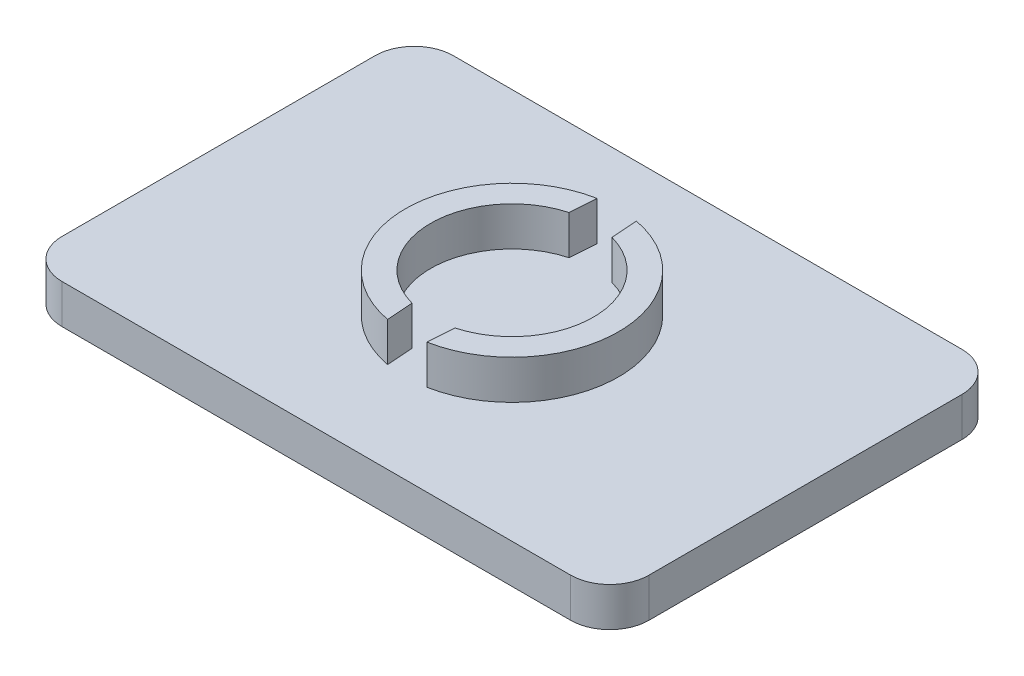
ISO-10303-21;
HEADER;
FILE_DESCRIPTION(('STEP AP214'),'2;1');
FILE_NAME('part.step','',(''),(''),'','','');
FILE_SCHEMA(('AUTOMOTIVE_DESIGN { 1 0 10303 214 1 1 1 1 }'));
ENDSEC;
DATA;
#1=APPLICATION_CONTEXT('core data for automotive mechanical design processes');
#2=APPLICATION_PROTOCOL_DEFINITION('international standard','automotive_design',2000,#1);
#3=PRODUCT_CONTEXT('',#1,'mechanical');
#4=PRODUCT('Part','Part','',(#3));
#5=PRODUCT_RELATED_PRODUCT_CATEGORY('part','',(#4));
#6=PRODUCT_DEFINITION_FORMATION('','',#4);
#7=PRODUCT_DEFINITION_CONTEXT('part definition',#1,'design');
#8=PRODUCT_DEFINITION('design','',#6,#7);
#9=PRODUCT_DEFINITION_SHAPE('','',#8);
#10=(LENGTH_UNIT() NAMED_UNIT(*) SI_UNIT(.MILLI.,.METRE.));
#11=(NAMED_UNIT(*) PLANE_ANGLE_UNIT() SI_UNIT($,.RADIAN.));
#12=(NAMED_UNIT(*) SI_UNIT($,.STERADIAN.) SOLID_ANGLE_UNIT());
#13=UNCERTAINTY_MEASURE_WITH_UNIT(LENGTH_MEASURE(1.E-05),#10,'distance_accuracy_value','');
#14=(GEOMETRIC_REPRESENTATION_CONTEXT(3) GLOBAL_UNCERTAINTY_ASSIGNED_CONTEXT((#13)) GLOBAL_UNIT_ASSIGNED_CONTEXT((#10,
#11,#12)) REPRESENTATION_CONTEXT('',''));
#15=CARTESIAN_POINT('',(0.,0.,0.));
#16=DIRECTION('',(0.,0.,1.));
#17=DIRECTION('',(1.,0.,0.));
#18=AXIS2_PLACEMENT_3D('',#15,#16,#17);
#19=CARTESIAN_POINT('',(0.,5.08,0.));
#20=DIRECTION('',(0.,-1.,0.));
#21=DIRECTION('',(0.,0.,-1.));
#22=AXIS2_PLACEMENT_3D('',#19,#20,#21);
#23=PLANE('',#22);
#24=DIRECTION('',(-0.0741774245024507,0.,-0.99724505999989));
#25=VECTOR('',#24,1.);
#26=CARTESIAN_POINT('',(-3.53248268967324,5.08,0.262754340462192));
#27=LINE('',#26,#25);
#28=CARTESIAN_POINT('',(-2.53999999999999,5.08,13.6057419954103));
#29=VERTEX_POINT('',#28);
#30=CARTESIAN_POINT('',(-2.79399999999999,5.08,10.1909531032507));
#31=VERTEX_POINT('',#30);
#32=EDGE_CURVE('E184',#29,#31,#27,.T.);
#33=ORIENTED_EDGE('',*,*,#32,.F.);
#34=CARTESIAN_POINT('',(0.,5.08,0.));
#35=DIRECTION('',(0.,-1.,0.));
#36=DIRECTION('',(0.,0.,-1.));
#37=AXIS2_PLACEMENT_3D('',#34,#35,#36);
#38=CIRCLE('',#37,13.8408025506353);
#39=CARTESIAN_POINT('',(-2.54000000000001,5.08,-13.6057419954103));
#40=VERTEX_POINT('',#39);
#41=EDGE_CURVE('E211',#29,#40,#38,.T.);
#42=ORIENTED_EDGE('',*,*,#41,.T.);
#43=DIRECTION('',(0.0741774245024495,0.,-0.99724505999989));
#44=VECTOR('',#43,1.);
#45=CARTESIAN_POINT('',(-3.53248268967323,5.08,-0.262754340462187));
#46=LINE('',#45,#44);
#47=CARTESIAN_POINT('',(-2.794,5.08,-10.1909531032507));
#48=VERTEX_POINT('',#47);
#49=EDGE_CURVE('E69',#48,#40,#46,.T.);
#50=ORIENTED_EDGE('',*,*,#49,.F.);
#51=CARTESIAN_POINT('',(0.,5.08,0.));
#52=DIRECTION('',(0.,-1.,0.));
#53=DIRECTION('',(0.,0.,-1.));
#54=AXIS2_PLACEMENT_3D('',#51,#52,#53);
#55=CIRCLE('',#54,10.5670223408799);
#56=EDGE_CURVE('E189',#31,#48,#55,.T.);
#57=ORIENTED_EDGE('',*,*,#56,.F.);
#58=EDGE_LOOP('',(#33,#42,#50,#57));
#59=FACE_BOUND('',#58,.T.);
#60=DIRECTION('',(-1.,0.,0.));
#61=VECTOR('',#60,1.);
#62=CARTESIAN_POINT('',(38.1,5.08,-25.4));
#63=LINE('',#62,#61);
#64=CARTESIAN_POINT('',(33.02,5.08,-25.4));
#65=VERTEX_POINT('',#64);
#66=CARTESIAN_POINT('',(-33.02,5.08,-25.4));
#67=VERTEX_POINT('',#66);
#68=EDGE_CURVE('E241',#65,#67,#63,.T.);
#69=ORIENTED_EDGE('',*,*,#68,.T.);
#70=CARTESIAN_POINT('',(-33.02,5.08,-20.32));
#71=DIRECTION('',(0.,-1.,0.));
#72=DIRECTION('',(0.,0.,-1.));
#73=AXIS2_PLACEMENT_3D('',#70,#71,#72);
#74=CIRCLE('',#73,5.08);
#75=CARTESIAN_POINT('',(-38.1,5.08,-20.32));
#76=VERTEX_POINT('',#75);
#77=EDGE_CURVE('E307',#67,#76,#74,.F.);
#78=ORIENTED_EDGE('',*,*,#77,.T.);
#79=DIRECTION('',(0.,0.,-1.));
#80=VECTOR('',#79,1.);
#81=CARTESIAN_POINT('',(-38.1,5.08,25.4));
#82=LINE('',#81,#80);
#83=CARTESIAN_POINT('',(-38.1,5.08,20.32));
#84=VERTEX_POINT('',#83);
#85=EDGE_CURVE('E245',#84,#76,#82,.T.);
#86=ORIENTED_EDGE('',*,*,#85,.F.);
#87=CARTESIAN_POINT('',(-33.02,5.08,20.32));
#88=DIRECTION('',(0.,-1.,0.));
#89=DIRECTION('',(0.,0.,-1.));
#90=AXIS2_PLACEMENT_3D('',#87,#88,#89);
#91=CIRCLE('',#90,5.08);
#92=CARTESIAN_POINT('',(-33.02,5.08,25.4));
#93=VERTEX_POINT('',#92);
#94=EDGE_CURVE('E298',#84,#93,#91,.F.);
#95=ORIENTED_EDGE('',*,*,#94,.T.);
#96=DIRECTION('',(-1.,0.,0.));
#97=VECTOR('',#96,1.);
#98=CARTESIAN_POINT('',(38.1,5.08,25.4));
#99=LINE('',#98,#97);
#100=CARTESIAN_POINT('',(33.02,5.08,25.4));
#101=VERTEX_POINT('',#100);
#102=EDGE_CURVE('E250',#101,#93,#99,.T.);
#103=ORIENTED_EDGE('',*,*,#102,.F.);
#104=CARTESIAN_POINT('',(33.02,5.08,20.32));
#105=DIRECTION('',(0.,-1.,0.));
#106=DIRECTION('',(0.,0.,-1.));
#107=AXIS2_PLACEMENT_3D('',#104,#105,#106);
#108=CIRCLE('',#107,5.08);
#109=CARTESIAN_POINT('',(38.1,5.08,20.32));
#110=VERTEX_POINT('',#109);
#111=EDGE_CURVE('E301',#101,#110,#108,.F.);
#112=ORIENTED_EDGE('',*,*,#111,.T.);
#113=DIRECTION('',(0.,0.,-1.));
#114=VECTOR('',#113,1.);
#115=CARTESIAN_POINT('',(38.1,5.08,25.4));
#116=LINE('',#115,#114);
#117=CARTESIAN_POINT('',(38.1,5.08,-20.32));
#118=VERTEX_POINT('',#117);
#119=EDGE_CURVE('E254',#110,#118,#116,.T.);
#120=ORIENTED_EDGE('',*,*,#119,.T.);
#121=CARTESIAN_POINT('',(33.02,5.08,-20.32));
#122=DIRECTION('',(0.,-1.,0.));
#123=DIRECTION('',(0.,0.,-1.));
#124=AXIS2_PLACEMENT_3D('',#121,#122,#123);
#125=CIRCLE('',#124,5.08);
#126=EDGE_CURVE('E304',#118,#65,#125,.F.);
#127=ORIENTED_EDGE('',*,*,#126,.T.);
#128=EDGE_LOOP('',(#69,#78,#86,#95,#103,#112,#120,#127));
#129=FACE_BOUND('',#128,.T.);
#130=CARTESIAN_POINT('',(0.,5.08,0.));
#131=DIRECTION('',(0.,-1.,0.));
#132=DIRECTION('',(0.,0.,-1.));
#133=AXIS2_PLACEMENT_3D('',#130,#131,#132);
#134=CIRCLE('',#133,10.5670223408799);
#135=CARTESIAN_POINT('',(2.794,5.08,-10.1909531032507));
#136=VERTEX_POINT('',#135);
#137=CARTESIAN_POINT('',(2.79400000000001,5.08,10.1909531032507));
#138=VERTEX_POINT('',#137);
#139=EDGE_CURVE('E165',#136,#138,#134,.T.);
#140=ORIENTED_EDGE('',*,*,#139,.F.);
#141=DIRECTION('',(-0.0741774245024498,0.,-0.99724505999989));
#142=VECTOR('',#141,1.);
#143=CARTESIAN_POINT('',(3.53248268967323,5.08,-0.262754340462189));
#144=LINE('',#143,#142);
#145=CARTESIAN_POINT('',(2.54,5.08,-13.6057419954103));
#146=VERTEX_POINT('',#145);
#147=EDGE_CURVE('E176',#136,#146,#144,.T.);
#148=ORIENTED_EDGE('',*,*,#147,.T.);
#149=CARTESIAN_POINT('',(0.,5.08,0.));
#150=DIRECTION('',(0.,-1.,0.));
#151=DIRECTION('',(0.,0.,-1.));
#152=AXIS2_PLACEMENT_3D('',#149,#150,#151);
#153=CIRCLE('',#152,13.8408025506353);
#154=CARTESIAN_POINT('',(2.54,5.08,13.6057419954103));
#155=VERTEX_POINT('',#154);
#156=EDGE_CURVE('E61',#146,#155,#153,.T.);
#157=ORIENTED_EDGE('',*,*,#156,.T.);
#158=DIRECTION('',(0.0741774245024505,0.,-0.99724505999989));
#159=VECTOR('',#158,1.);
#160=CARTESIAN_POINT('',(3.53248268967324,5.08,0.262754340462192));
#161=LINE('',#160,#159);
#162=EDGE_CURVE('E182',#155,#138,#161,.T.);
#163=ORIENTED_EDGE('',*,*,#162,.T.);
#164=EDGE_LOOP('',(#140,#148,#157,#163));
#165=FACE_BOUND('',#164,.T.);
#166=ADVANCED_FACE('F45',(#59,#129,#165),#23,.F.);
#167=CARTESIAN_POINT('',(38.1,5.08,-25.4));
#168=DIRECTION('',(0.,0.,1.));
#169=DIRECTION('',(1.,0.,0.));
#170=AXIS2_PLACEMENT_3D('',#167,#168,#169);
#171=PLANE('',#170);
#172=DIRECTION('',(-1.,0.,0.));
#173=VECTOR('',#172,1.);
#174=CARTESIAN_POINT('',(38.1,0.,-25.4));
#175=LINE('',#174,#173);
#176=CARTESIAN_POINT('',(33.02,0.,-25.4));
#177=VERTEX_POINT('',#176);
#178=CARTESIAN_POINT('',(-33.02,0.,-25.4));
#179=VERTEX_POINT('',#178);
#180=EDGE_CURVE('E240',#177,#179,#175,.T.);
#181=ORIENTED_EDGE('',*,*,#180,.T.);
#182=DIRECTION('',(0.,-1.,0.));
#183=VECTOR('',#182,1.);
#184=CARTESIAN_POINT('',(-33.02,5.08,-25.4));
#185=LINE('',#184,#183);
#186=EDGE_CURVE('E295',#179,#67,#185,.F.);
#187=ORIENTED_EDGE('',*,*,#186,.T.);
#188=ORIENTED_EDGE('',*,*,#68,.F.);
#189=DIRECTION('',(0.,-1.,0.));
#190=VECTOR('',#189,1.);
#191=CARTESIAN_POINT('',(33.02,5.08,-25.4));
#192=LINE('',#191,#190);
#193=EDGE_CURVE('E291',#65,#177,#192,.T.);
#194=ORIENTED_EDGE('',*,*,#193,.T.);
#195=EDGE_LOOP('',(#181,#187,#188,#194));
#196=FACE_BOUND('',#195,.T.);
#197=ADVANCED_FACE('F346',(#196),#171,.F.);
#198=CARTESIAN_POINT('',(-38.1,5.08,25.4));
#199=DIRECTION('',(-1.,0.,0.));
#200=DIRECTION('',(0.,0.,1.));
#201=AXIS2_PLACEMENT_3D('',#198,#199,#200);
#202=PLANE('',#201);
#203=ORIENTED_EDGE('',*,*,#85,.T.);
#204=DIRECTION('',(0.,-1.,0.));
#205=VECTOR('',#204,1.);
#206=CARTESIAN_POINT('',(-38.1,0.,-20.32));
#207=LINE('',#206,#205);
#208=CARTESIAN_POINT('',(-38.1,0.,-20.32));
#209=VERTEX_POINT('',#208);
#210=EDGE_CURVE('E275',#76,#209,#207,.T.);
#211=ORIENTED_EDGE('',*,*,#210,.T.);
#212=DIRECTION('',(0.,0.,-1.));
#213=VECTOR('',#212,1.);
#214=CARTESIAN_POINT('',(-38.1,0.,25.4));
#215=LINE('',#214,#213);
#216=CARTESIAN_POINT('',(-38.1,0.,20.32));
#217=VERTEX_POINT('',#216);
#218=EDGE_CURVE('E262',#217,#209,#215,.T.);
#219=ORIENTED_EDGE('',*,*,#218,.F.);
#220=DIRECTION('',(0.,-1.,0.));
#221=VECTOR('',#220,1.);
#222=CARTESIAN_POINT('',(-38.1,5.08,20.32));
#223=LINE('',#222,#221);
#224=EDGE_CURVE('E258',#217,#84,#223,.F.);
#225=ORIENTED_EDGE('',*,*,#224,.T.);
#226=EDGE_LOOP('',(#203,#211,#219,#225));
#227=FACE_BOUND('',#226,.T.);
#228=ADVANCED_FACE('F353',(#227),#202,.T.);
#229=CARTESIAN_POINT('',(38.1,5.08,25.4));
#230=DIRECTION('',(0.,0.,1.));
#231=DIRECTION('',(1.,0.,0.));
#232=AXIS2_PLACEMENT_3D('',#229,#230,#231);
#233=PLANE('',#232);
#234=DIRECTION('',(-1.,0.,0.));
#235=VECTOR('',#234,1.);
#236=CARTESIAN_POINT('',(38.1,0.,25.4));
#237=LINE('',#236,#235);
#238=CARTESIAN_POINT('',(33.02,0.,25.4));
#239=VERTEX_POINT('',#238);
#240=CARTESIAN_POINT('',(-33.02,0.,25.4));
#241=VERTEX_POINT('',#240);
#242=EDGE_CURVE('E266',#239,#241,#237,.T.);
#243=ORIENTED_EDGE('',*,*,#242,.F.);
#244=DIRECTION('',(0.,-1.,0.));
#245=VECTOR('',#244,1.);
#246=CARTESIAN_POINT('',(33.02,5.08,25.4));
#247=LINE('',#246,#245);
#248=EDGE_CURVE('E11',#239,#101,#247,.F.);
#249=ORIENTED_EDGE('',*,*,#248,.T.);
#250=ORIENTED_EDGE('',*,*,#102,.T.);
#251=DIRECTION('',(0.,-1.,0.));
#252=VECTOR('',#251,1.);
#253=CARTESIAN_POINT('',(-33.02,5.08,25.4));
#254=LINE('',#253,#252);
#255=EDGE_CURVE('E54',#93,#241,#254,.T.);
#256=ORIENTED_EDGE('',*,*,#255,.T.);
#257=EDGE_LOOP('',(#243,#249,#250,#256));
#258=FACE_BOUND('',#257,.T.);
#259=ADVANCED_FACE('F321',(#258),#233,.T.);
#260=CARTESIAN_POINT('',(38.1,5.08,25.4));
#261=DIRECTION('',(-1.,0.,0.));
#262=DIRECTION('',(0.,0.,1.));
#263=AXIS2_PLACEMENT_3D('',#260,#261,#262);
#264=PLANE('',#263);
#265=DIRECTION('',(0.,0.,-1.));
#266=VECTOR('',#265,1.);
#267=CARTESIAN_POINT('',(38.1,0.,25.4));
#268=LINE('',#267,#266);
#269=CARTESIAN_POINT('',(38.1,0.,20.32));
#270=VERTEX_POINT('',#269);
#271=CARTESIAN_POINT('',(38.1,0.,-20.32));
#272=VERTEX_POINT('',#271);
#273=EDGE_CURVE('E246',#270,#272,#268,.T.);
#274=ORIENTED_EDGE('',*,*,#273,.T.);
#275=DIRECTION('',(0.,-1.,0.));
#276=VECTOR('',#275,1.);
#277=CARTESIAN_POINT('',(38.1,5.08,-20.32));
#278=LINE('',#277,#276);
#279=EDGE_CURVE('E314',#272,#118,#278,.F.);
#280=ORIENTED_EDGE('',*,*,#279,.T.);
#281=ORIENTED_EDGE('',*,*,#119,.F.);
#282=DIRECTION('',(0.,-1.,0.));
#283=VECTOR('',#282,1.);
#284=CARTESIAN_POINT('',(38.1,0.,20.32));
#285=LINE('',#284,#283);
#286=EDGE_CURVE('E310',#110,#270,#285,.T.);
#287=ORIENTED_EDGE('',*,*,#286,.T.);
#288=EDGE_LOOP('',(#274,#280,#281,#287));
#289=FACE_BOUND('',#288,.T.);
#290=ADVANCED_FACE('F336',(#289),#264,.F.);
#291=CARTESIAN_POINT('',(0.,0.,0.));
#292=DIRECTION('',(0.,-1.,0.));
#293=DIRECTION('',(0.,0.,-1.));
#294=AXIS2_PLACEMENT_3D('',#291,#292,#293);
#295=PLANE('',#294);
#296=ORIENTED_EDGE('',*,*,#218,.T.);
#297=CARTESIAN_POINT('',(-33.02,0.,-20.32));
#298=DIRECTION('',(0.,-1.,0.));
#299=DIRECTION('',(0.,0.,-1.));
#300=AXIS2_PLACEMENT_3D('',#297,#298,#299);
#301=CIRCLE('',#300,5.08);
#302=EDGE_CURVE('E288',#209,#179,#301,.T.);
#303=ORIENTED_EDGE('',*,*,#302,.T.);
#304=ORIENTED_EDGE('',*,*,#180,.F.);
#305=CARTESIAN_POINT('',(33.02,0.,-20.32));
#306=DIRECTION('',(0.,-1.,0.));
#307=DIRECTION('',(0.,0.,-1.));
#308=AXIS2_PLACEMENT_3D('',#305,#306,#307);
#309=CIRCLE('',#308,5.08);
#310=EDGE_CURVE('E285',#177,#272,#309,.T.);
#311=ORIENTED_EDGE('',*,*,#310,.T.);
#312=ORIENTED_EDGE('',*,*,#273,.F.);
#313=CARTESIAN_POINT('',(33.02,0.,20.32));
#314=DIRECTION('',(0.,-1.,0.));
#315=DIRECTION('',(0.,0.,-1.));
#316=AXIS2_PLACEMENT_3D('',#313,#314,#315);
#317=CIRCLE('',#316,5.08);
#318=EDGE_CURVE('E282',#270,#239,#317,.T.);
#319=ORIENTED_EDGE('',*,*,#318,.T.);
#320=ORIENTED_EDGE('',*,*,#242,.T.);
#321=CARTESIAN_POINT('',(-33.02,0.,20.32));
#322=DIRECTION('',(0.,-1.,0.));
#323=DIRECTION('',(0.,0.,-1.));
#324=AXIS2_PLACEMENT_3D('',#321,#322,#323);
#325=CIRCLE('',#324,5.08);
#326=EDGE_CURVE('E279',#241,#217,#325,.T.);
#327=ORIENTED_EDGE('',*,*,#326,.T.);
#328=EDGE_LOOP('',(#296,#303,#304,#311,#312,#319,#320,#327));
#329=FACE_BOUND('',#328,.T.);
#330=ADVANCED_FACE('F327',(#329),#295,.T.);
#331=CARTESIAN_POINT('',(-33.02,5.08,-20.32));
#332=DIRECTION('',(0.,1.,0.));
#333=DIRECTION('',(0.,0.,1.));
#334=AXIS2_PLACEMENT_3D('',#331,#332,#333);
#335=CYLINDRICAL_SURFACE('',#334,5.08);
#336=ORIENTED_EDGE('',*,*,#77,.F.);
#337=ORIENTED_EDGE('',*,*,#186,.F.);
#338=ORIENTED_EDGE('',*,*,#302,.F.);
#339=ORIENTED_EDGE('',*,*,#210,.F.);
#340=EDGE_LOOP('',(#336,#337,#338,#339));
#341=FACE_BOUND('',#340,.T.);
#342=ADVANCED_FACE('F351',(#341),#335,.T.);
#343=CARTESIAN_POINT('',(33.02,5.08,-20.32));
#344=DIRECTION('',(0.,-1.,0.));
#345=DIRECTION('',(0.,0.,-1.));
#346=AXIS2_PLACEMENT_3D('',#343,#344,#345);
#347=CYLINDRICAL_SURFACE('',#346,5.08);
#348=ORIENTED_EDGE('',*,*,#126,.F.);
#349=ORIENTED_EDGE('',*,*,#279,.F.);
#350=ORIENTED_EDGE('',*,*,#310,.F.);
#351=ORIENTED_EDGE('',*,*,#193,.F.);
#352=EDGE_LOOP('',(#348,#349,#350,#351));
#353=FACE_BOUND('',#352,.T.);
#354=ADVANCED_FACE('F343',(#353),#347,.T.);
#355=CARTESIAN_POINT('',(33.02,5.08,20.32));
#356=DIRECTION('',(0.,1.,0.));
#357=DIRECTION('',(0.,0.,1.));
#358=AXIS2_PLACEMENT_3D('',#355,#356,#357);
#359=CYLINDRICAL_SURFACE('',#358,5.08);
#360=ORIENTED_EDGE('',*,*,#111,.F.);
#361=ORIENTED_EDGE('',*,*,#248,.F.);
#362=ORIENTED_EDGE('',*,*,#318,.F.);
#363=ORIENTED_EDGE('',*,*,#286,.F.);
#364=EDGE_LOOP('',(#360,#361,#362,#363));
#365=FACE_BOUND('',#364,.T.);
#366=ADVANCED_FACE('F333',(#365),#359,.T.);
#367=CARTESIAN_POINT('',(-33.02,5.08,20.32));
#368=DIRECTION('',(0.,-1.,0.));
#369=DIRECTION('',(0.,0.,-1.));
#370=AXIS2_PLACEMENT_3D('',#367,#368,#369);
#371=CYLINDRICAL_SURFACE('',#370,5.08);
#372=ORIENTED_EDGE('',*,*,#94,.F.);
#373=ORIENTED_EDGE('',*,*,#224,.F.);
#374=ORIENTED_EDGE('',*,*,#326,.F.);
#375=ORIENTED_EDGE('',*,*,#255,.F.);
#376=EDGE_LOOP('',(#372,#373,#374,#375));
#377=FACE_BOUND('',#376,.T.);
#378=ADVANCED_FACE('F47',(#377),#371,.T.);
#379=CARTESIAN_POINT('',(-3.53248268967324,10.16,0.262754340462192));
#380=DIRECTION('',(-0.997245059999889,0.,0.0741774245024507));
#381=DIRECTION('',(0.0741774245024507,0.,0.99724505999989));
#382=AXIS2_PLACEMENT_3D('',#379,#380,#381);
#383=PLANE('',#382);
#384=ORIENTED_EDGE('',*,*,#32,.T.);
#385=DIRECTION('',(0.,-1.,0.));
#386=VECTOR('',#385,1.);
#387=CARTESIAN_POINT('',(-2.79399999999999,10.16,10.1909531032507));
#388=LINE('',#387,#386);
#389=CARTESIAN_POINT('',(-2.79399999999999,10.16,10.1909531032507));
#390=VERTEX_POINT('',#389);
#391=EDGE_CURVE('E237',#390,#31,#388,.T.);
#392=ORIENTED_EDGE('',*,*,#391,.F.);
#393=DIRECTION('',(-0.0741774245024507,0.,-0.99724505999989));
#394=VECTOR('',#393,1.);
#395=CARTESIAN_POINT('',(-3.53248268967324,10.16,0.262754340462192));
#396=LINE('',#395,#394);
#397=CARTESIAN_POINT('',(-2.53999999999999,10.16,13.6057419954103));
#398=VERTEX_POINT('',#397);
#399=EDGE_CURVE('E206',#398,#390,#396,.T.);
#400=ORIENTED_EDGE('',*,*,#399,.F.);
#401=DIRECTION('',(0.,-1.,0.));
#402=VECTOR('',#401,1.);
#403=CARTESIAN_POINT('',(-2.53999999999999,10.16,13.6057419954103));
#404=LINE('',#403,#402);
#405=EDGE_CURVE('E220',#398,#29,#404,.T.);
#406=ORIENTED_EDGE('',*,*,#405,.T.);
#407=EDGE_LOOP('',(#384,#392,#400,#406));
#408=FACE_BOUND('',#407,.T.);
#409=ADVANCED_FACE('F357',(#408),#383,.F.);
#410=CARTESIAN_POINT('',(0.,10.16,0.));
#411=DIRECTION('',(0.,-1.,0.));
#412=DIRECTION('',(0.,0.,-1.));
#413=AXIS2_PLACEMENT_3D('',#410,#411,#412);
#414=CYLINDRICAL_SURFACE('',#413,10.5670223408799);
#415=ORIENTED_EDGE('',*,*,#56,.T.);
#416=DIRECTION('',(0.,-1.,0.));
#417=VECTOR('',#416,1.);
#418=CARTESIAN_POINT('',(-2.794,10.16,-10.1909531032507));
#419=LINE('',#418,#417);
#420=CARTESIAN_POINT('',(-2.794,10.16,-10.1909531032507));
#421=VERTEX_POINT('',#420);
#422=EDGE_CURVE('E234',#421,#48,#419,.T.);
#423=ORIENTED_EDGE('',*,*,#422,.F.);
#424=CARTESIAN_POINT('',(0.,10.16,0.));
#425=DIRECTION('',(0.,-1.,0.));
#426=DIRECTION('',(0.,0.,-1.));
#427=AXIS2_PLACEMENT_3D('',#424,#425,#426);
#428=CIRCLE('',#427,10.5670223408799);
#429=EDGE_CURVE('E210',#390,#421,#428,.T.);
#430=ORIENTED_EDGE('',*,*,#429,.F.);
#431=ORIENTED_EDGE('',*,*,#391,.T.);
#432=EDGE_LOOP('',(#415,#423,#430,#431));
#433=FACE_BOUND('',#432,.T.);
#434=ADVANCED_FACE('F362',(#433),#414,.F.);
#435=CARTESIAN_POINT('',(-3.53248268967323,10.16,-0.262754340462187));
#436=DIRECTION('',(-0.99724505999989,0.,-0.0741774245024495));
#437=DIRECTION('',(-0.0741774245024495,0.,0.99724505999989));
#438=AXIS2_PLACEMENT_3D('',#435,#436,#437);
#439=PLANE('',#438);
#440=ORIENTED_EDGE('',*,*,#49,.T.);
#441=DIRECTION('',(0.,-1.,0.));
#442=VECTOR('',#441,1.);
#443=CARTESIAN_POINT('',(-2.54000000000001,10.16,-13.6057419954103));
#444=LINE('',#443,#442);
#445=CARTESIAN_POINT('',(-2.54000000000001,10.16,-13.6057419954103));
#446=VERTEX_POINT('',#445);
#447=EDGE_CURVE('E231',#446,#40,#444,.T.);
#448=ORIENTED_EDGE('',*,*,#447,.F.);
#449=DIRECTION('',(0.0741774245024495,0.,-0.99724505999989));
#450=VECTOR('',#449,1.);
#451=CARTESIAN_POINT('',(-3.53248268967323,10.16,-0.262754340462187));
#452=LINE('',#451,#450);
#453=EDGE_CURVE('E214',#421,#446,#452,.T.);
#454=ORIENTED_EDGE('',*,*,#453,.F.);
#455=ORIENTED_EDGE('',*,*,#422,.T.);
#456=EDGE_LOOP('',(#440,#448,#454,#455));
#457=FACE_BOUND('',#456,.T.);
#458=ADVANCED_FACE('F414',(#457),#439,.F.);
#459=CARTESIAN_POINT('',(0.,10.16,0.));
#460=DIRECTION('',(0.,-1.,0.));
#461=DIRECTION('',(0.,0.,-1.));
#462=AXIS2_PLACEMENT_3D('',#459,#460,#461);
#463=CYLINDRICAL_SURFACE('',#462,13.8408025506353);
#464=ORIENTED_EDGE('',*,*,#41,.F.);
#465=ORIENTED_EDGE('',*,*,#405,.F.);
#466=CARTESIAN_POINT('',(0.,10.16,0.));
#467=DIRECTION('',(0.,-1.,0.));
#468=DIRECTION('',(0.,0.,-1.));
#469=AXIS2_PLACEMENT_3D('',#466,#467,#468);
#470=CIRCLE('',#469,13.8408025506353);
#471=EDGE_CURVE('E217',#398,#446,#470,.T.);
#472=ORIENTED_EDGE('',*,*,#471,.T.);
#473=ORIENTED_EDGE('',*,*,#447,.T.);
#474=EDGE_LOOP('',(#464,#465,#472,#473));
#475=FACE_BOUND('',#474,.T.);
#476=ADVANCED_FACE('F423',(#475),#463,.T.);
#477=CARTESIAN_POINT('',(0.,10.16,0.));
#478=DIRECTION('',(0.,-1.,0.));
#479=DIRECTION('',(0.,0.,-1.));
#480=AXIS2_PLACEMENT_3D('',#477,#478,#479);
#481=PLANE('',#480);
#482=ORIENTED_EDGE('',*,*,#399,.T.);
#483=ORIENTED_EDGE('',*,*,#429,.T.);
#484=ORIENTED_EDGE('',*,*,#453,.T.);
#485=ORIENTED_EDGE('',*,*,#471,.F.);
#486=EDGE_LOOP('',(#482,#483,#484,#485));
#487=FACE_BOUND('',#486,.T.);
#488=ADVANCED_FACE('F432',(#487),#481,.F.);
#489=CARTESIAN_POINT('',(0.,10.16,0.));
#490=DIRECTION('',(0.,-1.,0.));
#491=DIRECTION('',(0.,0.,-1.));
#492=AXIS2_PLACEMENT_3D('',#489,#490,#491);
#493=CYLINDRICAL_SURFACE('',#492,10.5670223408799);
#494=ORIENTED_EDGE('',*,*,#139,.T.);
#495=DIRECTION('',(0.,-1.,0.));
#496=VECTOR('',#495,1.);
#497=CARTESIAN_POINT('',(2.79400000000001,10.16,10.1909531032507));
#498=LINE('',#497,#496);
#499=CARTESIAN_POINT('',(2.79400000000001,10.16,10.1909531032507));
#500=VERTEX_POINT('',#499);
#501=EDGE_CURVE('E612',#500,#138,#498,.T.);
#502=ORIENTED_EDGE('',*,*,#501,.F.);
#503=CARTESIAN_POINT('',(0.,10.16,0.));
#504=DIRECTION('',(0.,-1.,0.));
#505=DIRECTION('',(0.,0.,-1.));
#506=AXIS2_PLACEMENT_3D('',#503,#504,#505);
#507=CIRCLE('',#506,10.5670223408799);
#508=CARTESIAN_POINT('',(2.794,10.16,-10.1909531032507));
#509=VERTEX_POINT('',#508);
#510=EDGE_CURVE('E167',#509,#500,#507,.T.);
#511=ORIENTED_EDGE('',*,*,#510,.F.);
#512=DIRECTION('',(0.,-1.,0.));
#513=VECTOR('',#512,1.);
#514=CARTESIAN_POINT('',(2.794,10.16,-10.1909531032507));
#515=LINE('',#514,#513);
#516=EDGE_CURVE('E160',#509,#136,#515,.T.);
#517=ORIENTED_EDGE('',*,*,#516,.T.);
#518=EDGE_LOOP('',(#494,#502,#511,#517));
#519=FACE_BOUND('',#518,.T.);
#520=ADVANCED_FACE('F162',(#519),#493,.F.);
#521=CARTESIAN_POINT('',(3.53248268967324,10.16,0.262754340462192));
#522=DIRECTION('',(-0.997245059999889,0.,-0.0741774245024504));
#523=DIRECTION('',(-0.0741774245024505,0.,0.99724505999989));
#524=AXIS2_PLACEMENT_3D('',#521,#522,#523);
#525=PLANE('',#524);
#526=ORIENTED_EDGE('',*,*,#162,.F.);
#527=DIRECTION('',(0.,-1.,0.));
#528=VECTOR('',#527,1.);
#529=CARTESIAN_POINT('',(2.54,10.16,13.6057419954103));
#530=LINE('',#529,#528);
#531=CARTESIAN_POINT('',(2.54,10.16,13.6057419954103));
#532=VERTEX_POINT('',#531);
#533=EDGE_CURVE('E614',#532,#155,#530,.T.);
#534=ORIENTED_EDGE('',*,*,#533,.F.);
#535=DIRECTION('',(0.0741774245024505,0.,-0.99724505999989));
#536=VECTOR('',#535,1.);
#537=CARTESIAN_POINT('',(3.53248268967324,10.16,0.262754340462192));
#538=LINE('',#537,#536);
#539=EDGE_CURVE('E200',#532,#500,#538,.T.);
#540=ORIENTED_EDGE('',*,*,#539,.T.);
#541=ORIENTED_EDGE('',*,*,#501,.T.);
#542=EDGE_LOOP('',(#526,#534,#540,#541));
#543=FACE_BOUND('',#542,.T.);
#544=ADVANCED_FACE('F451',(#543),#525,.T.);
#545=CARTESIAN_POINT('',(0.,10.16,0.));
#546=DIRECTION('',(0.,-1.,0.));
#547=DIRECTION('',(0.,0.,-1.));
#548=AXIS2_PLACEMENT_3D('',#545,#546,#547);
#549=CYLINDRICAL_SURFACE('',#548,13.8408025506353);
#550=ORIENTED_EDGE('',*,*,#156,.F.);
#551=DIRECTION('',(0.,-1.,0.));
#552=VECTOR('',#551,1.);
#553=CARTESIAN_POINT('',(2.54,10.16,-13.6057419954103));
#554=LINE('',#553,#552);
#555=CARTESIAN_POINT('',(2.54,10.16,-13.6057419954103));
#556=VERTEX_POINT('',#555);
#557=EDGE_CURVE('E173',#556,#146,#554,.T.);
#558=ORIENTED_EDGE('',*,*,#557,.F.);
#559=CARTESIAN_POINT('',(0.,10.16,0.));
#560=DIRECTION('',(0.,-1.,0.));
#561=DIRECTION('',(0.,0.,-1.));
#562=AXIS2_PLACEMENT_3D('',#559,#560,#561);
#563=CIRCLE('',#562,13.8408025506353);
#564=EDGE_CURVE('E196',#556,#532,#563,.T.);
#565=ORIENTED_EDGE('',*,*,#564,.T.);
#566=ORIENTED_EDGE('',*,*,#533,.T.);
#567=EDGE_LOOP('',(#550,#558,#565,#566));
#568=FACE_BOUND('',#567,.T.);
#569=ADVANCED_FACE('F460',(#568),#549,.T.);
#570=CARTESIAN_POINT('',(3.53248268967323,10.16,-0.262754340462189));
#571=DIRECTION('',(-0.99724505999989,0.,0.0741774245024498));
#572=DIRECTION('',(0.0741774245024498,0.,0.99724505999989));
#573=AXIS2_PLACEMENT_3D('',#570,#571,#572);
#574=PLANE('',#573);
#575=ORIENTED_EDGE('',*,*,#147,.F.);
#576=ORIENTED_EDGE('',*,*,#516,.F.);
#577=DIRECTION('',(-0.0741774245024498,0.,-0.99724505999989));
#578=VECTOR('',#577,1.);
#579=CARTESIAN_POINT('',(3.53248268967323,10.16,-0.262754340462189));
#580=LINE('',#579,#578);
#581=EDGE_CURVE('E172',#509,#556,#580,.T.);
#582=ORIENTED_EDGE('',*,*,#581,.T.);
#583=ORIENTED_EDGE('',*,*,#557,.T.);
#584=EDGE_LOOP('',(#575,#576,#582,#583));
#585=FACE_BOUND('',#584,.T.);
#586=ADVANCED_FACE('F177',(#585),#574,.T.);
#587=CARTESIAN_POINT('',(0.,10.16,0.));
#588=DIRECTION('',(0.,-1.,0.));
#589=DIRECTION('',(0.,0.,-1.));
#590=AXIS2_PLACEMENT_3D('',#587,#588,#589);
#591=PLANE('',#590);
#592=ORIENTED_EDGE('',*,*,#510,.T.);
#593=ORIENTED_EDGE('',*,*,#539,.F.);
#594=ORIENTED_EDGE('',*,*,#564,.F.);
#595=ORIENTED_EDGE('',*,*,#581,.F.);
#596=EDGE_LOOP('',(#592,#593,#594,#595));
#597=FACE_BOUND('',#596,.T.);
#598=ADVANCED_FACE('F478',(#597),#591,.F.);
#599=CLOSED_SHELL('',(#166,#197,#228,#259,#290,#330,#342,#354,#366,#378,#409,#434,#458,#476,
#488,#520,#544,#569,#586,#598));
#600=MANIFOLD_SOLID_BREP('B2',#599);
#601=ADVANCED_BREP_SHAPE_REPRESENTATION('',(#18,#600),#14);
#602=SHAPE_DEFINITION_REPRESENTATION(#9,#601);
ENDSEC;
END-ISO-10303-21;
